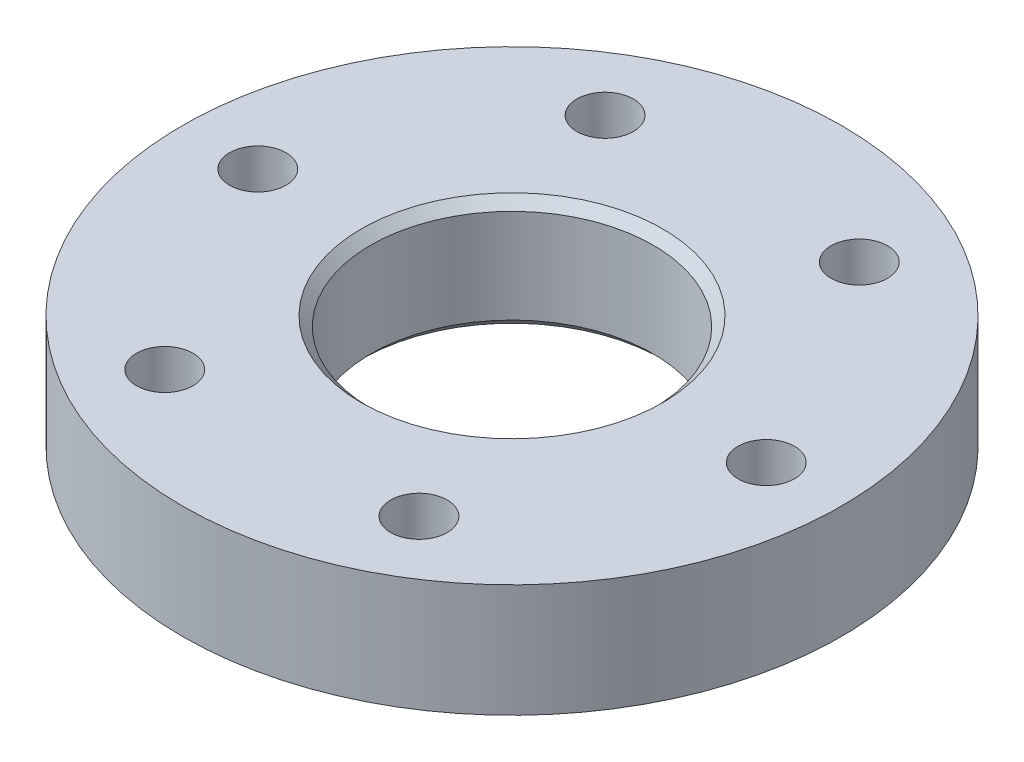
ISO-10303-21;
HEADER;
FILE_DESCRIPTION(('STEP AP214'),'2;1');
FILE_NAME('part.step','',(''),(''),'','','');
FILE_SCHEMA(('AUTOMOTIVE_DESIGN { 1 0 10303 214 1 1 1 1 }'));
ENDSEC;
DATA;
#1=APPLICATION_CONTEXT('core data for automotive mechanical design processes');
#2=APPLICATION_PROTOCOL_DEFINITION('international standard','automotive_design',2000,#1);
#3=PRODUCT_CONTEXT('',#1,'mechanical');
#4=PRODUCT('Part','Part','',(#3));
#5=PRODUCT_RELATED_PRODUCT_CATEGORY('part','',(#4));
#6=PRODUCT_DEFINITION_FORMATION('','',#4);
#7=PRODUCT_DEFINITION_CONTEXT('part definition',#1,'design');
#8=PRODUCT_DEFINITION('design','',#6,#7);
#9=PRODUCT_DEFINITION_SHAPE('','',#8);
#10=(LENGTH_UNIT() NAMED_UNIT(*) SI_UNIT(.MILLI.,.METRE.));
#11=(NAMED_UNIT(*) PLANE_ANGLE_UNIT() SI_UNIT($,.RADIAN.));
#12=(NAMED_UNIT(*) SI_UNIT($,.STERADIAN.) SOLID_ANGLE_UNIT());
#13=UNCERTAINTY_MEASURE_WITH_UNIT(LENGTH_MEASURE(1.E-05),#10,'distance_accuracy_value','');
#14=(GEOMETRIC_REPRESENTATION_CONTEXT(3) GLOBAL_UNCERTAINTY_ASSIGNED_CONTEXT((#13)) GLOBAL_UNIT_ASSIGNED_CONTEXT((#10,
#11,#12)) REPRESENTATION_CONTEXT('',''));
#15=CARTESIAN_POINT('',(0.,0.,0.));
#16=DIRECTION('',(0.,0.,1.));
#17=DIRECTION('',(1.,0.,0.));
#18=AXIS2_PLACEMENT_3D('',#15,#16,#17);
#19=CARTESIAN_POINT('',(13.5,3.,0.));
#20=DIRECTION('',(0.,-1.,0.));
#21=DIRECTION('',(0.,0.,-1.));
#22=AXIS2_PLACEMENT_3D('',#19,#20,#21);
#23=CYLINDRICAL_SURFACE('',#22,1.5);
#24=CARTESIAN_POINT('',(13.5,3.,0.));
#25=DIRECTION('',(0.,1.,0.));
#26=DIRECTION('',(0.,0.,1.));
#27=AXIS2_PLACEMENT_3D('',#24,#25,#26);
#28=CIRCLE('',#27,1.5);
#29=CARTESIAN_POINT('',(13.5,3.,1.5));
#30=VERTEX_POINT('',#29);
#31=EDGE_CURVE('E66',#30,#30,#28,.T.);
#32=ORIENTED_EDGE('',*,*,#31,.T.);
#33=EDGE_LOOP('',(#32));
#34=FACE_BOUND('',#33,.T.);
#35=CARTESIAN_POINT('',(13.5,-1.5,0.));
#36=DIRECTION('',(0.,-1.,0.));
#37=DIRECTION('',(0.,0.,-1.));
#38=AXIS2_PLACEMENT_3D('',#35,#36,#37);
#39=CIRCLE('',#38,1.5);
#40=CARTESIAN_POINT('',(13.5,-1.5,-1.5));
#41=VERTEX_POINT('',#40);
#42=EDGE_CURVE('E86',#41,#41,#39,.T.);
#43=ORIENTED_EDGE('',*,*,#42,.T.);
#44=EDGE_LOOP('',(#43));
#45=FACE_BOUND('',#44,.T.);
#46=ADVANCED_FACE('F38',(#34,#45),#23,.F.);
#47=CARTESIAN_POINT('',(6.74999999999997,3.,11.6913429510899));
#48=DIRECTION('',(0.,-1.,0.));
#49=DIRECTION('',(0.,0.,-1.));
#50=AXIS2_PLACEMENT_3D('',#47,#48,#49);
#51=CYLINDRICAL_SURFACE('',#50,1.5);
#52=CARTESIAN_POINT('',(6.74999999999997,3.,11.6913429510899));
#53=DIRECTION('',(0.,1.,0.));
#54=DIRECTION('',(0.,0.,1.));
#55=AXIS2_PLACEMENT_3D('',#52,#53,#54);
#56=CIRCLE('',#55,1.5);
#57=CARTESIAN_POINT('',(6.74999999999997,3.,13.1913429510899));
#58=VERTEX_POINT('',#57);
#59=EDGE_CURVE('E71',#58,#58,#56,.T.);
#60=ORIENTED_EDGE('',*,*,#59,.T.);
#61=EDGE_LOOP('',(#60));
#62=FACE_BOUND('',#61,.T.);
#63=CARTESIAN_POINT('',(6.74999999999997,-1.5,11.6913429510899));
#64=DIRECTION('',(0.,-1.,0.));
#65=DIRECTION('',(0.,0.,-1.));
#66=AXIS2_PLACEMENT_3D('',#63,#64,#65);
#67=CIRCLE('',#66,1.5);
#68=CARTESIAN_POINT('',(6.74999999999997,-1.5,10.1913429510899));
#69=VERTEX_POINT('',#68);
#70=EDGE_CURVE('E89',#69,#69,#67,.T.);
#71=ORIENTED_EDGE('',*,*,#70,.T.);
#72=EDGE_LOOP('',(#71));
#73=FACE_BOUND('',#72,.T.);
#74=ADVANCED_FACE('F120',(#62,#73),#51,.F.);
#75=CARTESIAN_POINT('',(-6.75000000000005,3.,11.6913429510899));
#76=DIRECTION('',(0.,-1.,0.));
#77=DIRECTION('',(0.,0.,-1.));
#78=AXIS2_PLACEMENT_3D('',#75,#76,#77);
#79=CYLINDRICAL_SURFACE('',#78,1.5);
#80=CARTESIAN_POINT('',(-6.75000000000005,3.,11.6913429510899));
#81=DIRECTION('',(0.,1.,0.));
#82=DIRECTION('',(0.,0.,1.));
#83=AXIS2_PLACEMENT_3D('',#80,#81,#82);
#84=CIRCLE('',#83,1.5);
#85=CARTESIAN_POINT('',(-6.75000000000005,3.,13.1913429510899));
#86=VERTEX_POINT('',#85);
#87=EDGE_CURVE('E74',#86,#86,#84,.T.);
#88=ORIENTED_EDGE('',*,*,#87,.T.);
#89=EDGE_LOOP('',(#88));
#90=FACE_BOUND('',#89,.T.);
#91=CARTESIAN_POINT('',(-6.75000000000005,-1.5,11.6913429510899));
#92=DIRECTION('',(0.,-1.,0.));
#93=DIRECTION('',(0.,0.,-1.));
#94=AXIS2_PLACEMENT_3D('',#91,#92,#93);
#95=CIRCLE('',#94,1.5);
#96=CARTESIAN_POINT('',(-6.75000000000005,-1.5,10.1913429510899));
#97=VERTEX_POINT('',#96);
#98=EDGE_CURVE('E92',#97,#97,#95,.T.);
#99=ORIENTED_EDGE('',*,*,#98,.T.);
#100=EDGE_LOOP('',(#99));
#101=FACE_BOUND('',#100,.T.);
#102=ADVANCED_FACE('F126',(#90,#101),#79,.F.);
#103=CARTESIAN_POINT('',(-13.5,3.,0.));
#104=DIRECTION('',(0.,-1.,0.));
#105=DIRECTION('',(0.,0.,-1.));
#106=AXIS2_PLACEMENT_3D('',#103,#104,#105);
#107=CYLINDRICAL_SURFACE('',#106,1.5);
#108=CARTESIAN_POINT('',(-13.5,3.,0.));
#109=DIRECTION('',(0.,1.,0.));
#110=DIRECTION('',(0.,0.,1.));
#111=AXIS2_PLACEMENT_3D('',#108,#109,#110);
#112=CIRCLE('',#111,1.5);
#113=CARTESIAN_POINT('',(-13.5,3.,1.4999999999999));
#114=VERTEX_POINT('',#113);
#115=EDGE_CURVE('E77',#114,#114,#112,.T.);
#116=ORIENTED_EDGE('',*,*,#115,.T.);
#117=EDGE_LOOP('',(#116));
#118=FACE_BOUND('',#117,.T.);
#119=CARTESIAN_POINT('',(-13.5,-1.5,0.));
#120=DIRECTION('',(0.,-1.,0.));
#121=DIRECTION('',(0.,0.,-1.));
#122=AXIS2_PLACEMENT_3D('',#119,#120,#121);
#123=CIRCLE('',#122,1.5);
#124=CARTESIAN_POINT('',(-13.5,-1.5,-1.50000000000009));
#125=VERTEX_POINT('',#124);
#126=EDGE_CURVE('E95',#125,#125,#123,.T.);
#127=ORIENTED_EDGE('',*,*,#126,.T.);
#128=EDGE_LOOP('',(#127));
#129=FACE_BOUND('',#128,.T.);
#130=ADVANCED_FACE('F177',(#118,#129),#107,.F.);
#131=CARTESIAN_POINT('',(-6.74999999999989,3.,-11.69134295109));
#132=DIRECTION('',(0.,-1.,0.));
#133=DIRECTION('',(0.,0.,-1.));
#134=AXIS2_PLACEMENT_3D('',#131,#132,#133);
#135=CYLINDRICAL_SURFACE('',#134,1.5);
#136=CARTESIAN_POINT('',(-6.74999999999989,3.,-11.69134295109));
#137=DIRECTION('',(0.,1.,0.));
#138=DIRECTION('',(0.,0.,1.));
#139=AXIS2_PLACEMENT_3D('',#136,#137,#138);
#140=CIRCLE('',#139,1.5);
#141=CARTESIAN_POINT('',(-6.74999999999989,3.,-10.19134295109));
#142=VERTEX_POINT('',#141);
#143=EDGE_CURVE('E80',#142,#142,#140,.T.);
#144=ORIENTED_EDGE('',*,*,#143,.T.);
#145=EDGE_LOOP('',(#144));
#146=FACE_BOUND('',#145,.T.);
#147=CARTESIAN_POINT('',(-6.74999999999989,-1.5,-11.69134295109));
#148=DIRECTION('',(0.,-1.,0.));
#149=DIRECTION('',(0.,0.,-1.));
#150=AXIS2_PLACEMENT_3D('',#147,#148,#149);
#151=CIRCLE('',#150,1.5);
#152=CARTESIAN_POINT('',(-6.74999999999989,-1.5,-13.19134295109));
#153=VERTEX_POINT('',#152);
#154=EDGE_CURVE('E98',#153,#153,#151,.T.);
#155=ORIENTED_EDGE('',*,*,#154,.T.);
#156=EDGE_LOOP('',(#155));
#157=FACE_BOUND('',#156,.T.);
#158=ADVANCED_FACE('F102',(#146,#157),#135,.F.);
#159=CARTESIAN_POINT('',(6.75000000000014,3.,-11.6913429510898));
#160=DIRECTION('',(0.,-1.,0.));
#161=DIRECTION('',(0.,0.,-1.));
#162=AXIS2_PLACEMENT_3D('',#159,#160,#161);
#163=CYLINDRICAL_SURFACE('',#162,1.5);
#164=CARTESIAN_POINT('',(6.75000000000014,3.,-11.6913429510898));
#165=DIRECTION('',(0.,1.,0.));
#166=DIRECTION('',(0.,0.,1.));
#167=AXIS2_PLACEMENT_3D('',#164,#165,#166);
#168=CIRCLE('',#167,1.5);
#169=CARTESIAN_POINT('',(6.75000000000014,3.,-10.1913429510898));
#170=VERTEX_POINT('',#169);
#171=EDGE_CURVE('E83',#170,#170,#168,.T.);
#172=ORIENTED_EDGE('',*,*,#171,.T.);
#173=EDGE_LOOP('',(#172));
#174=FACE_BOUND('',#173,.T.);
#175=CARTESIAN_POINT('',(6.75000000000014,-1.5,-11.6913429510898));
#176=DIRECTION('',(0.,-1.,0.));
#177=DIRECTION('',(0.,0.,-1.));
#178=AXIS2_PLACEMENT_3D('',#175,#176,#177);
#179=CIRCLE('',#178,1.5);
#180=CARTESIAN_POINT('',(6.75000000000014,-1.5,-13.1913429510898));
#181=VERTEX_POINT('',#180);
#182=EDGE_CURVE('E59',#181,#181,#179,.T.);
#183=ORIENTED_EDGE('',*,*,#182,.T.);
#184=EDGE_LOOP('',(#183));
#185=FACE_BOUND('',#184,.T.);
#186=ADVANCED_FACE('F136',(#174,#185),#163,.F.);
#187=CARTESIAN_POINT('',(0.,3.,0.));
#188=DIRECTION('',(0.,1.,0.));
#189=DIRECTION('',(0.,0.,1.));
#190=AXIS2_PLACEMENT_3D('',#187,#188,#189);
#191=PLANE('',#190);
#192=CARTESIAN_POINT('',(0.,3.,0.));
#193=DIRECTION('',(0.,1.,0.));
#194=DIRECTION('',(0.,0.,1.));
#195=AXIS2_PLACEMENT_3D('',#192,#193,#194);
#196=CIRCLE('',#195,8.00000000000001);
#197=CARTESIAN_POINT('',(0.,3.,8.00000000000001));
#198=VERTEX_POINT('',#197);
#199=EDGE_CURVE('E10',#198,#198,#196,.F.);
#200=ORIENTED_EDGE('',*,*,#199,.T.);
#201=EDGE_LOOP('',(#200));
#202=FACE_BOUND('',#201,.T.);
#203=ORIENTED_EDGE('',*,*,#143,.F.);
#204=EDGE_LOOP('',(#203));
#205=FACE_BOUND('',#204,.T.);
#206=ORIENTED_EDGE('',*,*,#87,.F.);
#207=EDGE_LOOP('',(#206));
#208=FACE_BOUND('',#207,.T.);
#209=CARTESIAN_POINT('',(0.,3.,0.));
#210=DIRECTION('',(0.,1.,0.));
#211=DIRECTION('',(0.,0.,1.));
#212=AXIS2_PLACEMENT_3D('',#209,#210,#211);
#213=CIRCLE('',#212,17.5);
#214=CARTESIAN_POINT('',(0.,3.,17.5));
#215=VERTEX_POINT('',#214);
#216=EDGE_CURVE('E62',#215,#215,#213,.T.);
#217=ORIENTED_EDGE('',*,*,#216,.T.);
#218=EDGE_LOOP('',(#217));
#219=FACE_BOUND('',#218,.T.);
#220=ORIENTED_EDGE('',*,*,#31,.F.);
#221=EDGE_LOOP('',(#220));
#222=FACE_BOUND('',#221,.T.);
#223=ORIENTED_EDGE('',*,*,#59,.F.);
#224=EDGE_LOOP('',(#223));
#225=FACE_BOUND('',#224,.T.);
#226=ORIENTED_EDGE('',*,*,#115,.F.);
#227=EDGE_LOOP('',(#226));
#228=FACE_BOUND('',#227,.T.);
#229=ORIENTED_EDGE('',*,*,#171,.F.);
#230=EDGE_LOOP('',(#229));
#231=FACE_BOUND('',#230,.T.);
#232=ADVANCED_FACE('F132',(#202,#205,#208,#219,#222,#225,#228,#231),#191,.T.);
#233=CARTESIAN_POINT('',(0.,-3.,0.));
#234=DIRECTION('',(0.,1.,0.));
#235=DIRECTION('',(0.,0.,1.));
#236=AXIS2_PLACEMENT_3D('',#233,#234,#235);
#237=PLANE('',#236);
#238=CARTESIAN_POINT('',(0.,-3.,0.));
#239=DIRECTION('',(0.,1.,0.));
#240=DIRECTION('',(0.,0.,1.));
#241=AXIS2_PLACEMENT_3D('',#238,#239,#240);
#242=CIRCLE('',#241,7.99999999999999);
#243=CARTESIAN_POINT('',(0.,-3.,7.99999999999999));
#244=VERTEX_POINT('',#243);
#245=EDGE_CURVE('E54',#244,#244,#242,.T.);
#246=ORIENTED_EDGE('',*,*,#245,.T.);
#247=EDGE_LOOP('',(#246));
#248=FACE_BOUND('',#247,.T.);
#249=CARTESIAN_POINT('',(0.,-3.,0.));
#250=DIRECTION('',(0.,1.,0.));
#251=DIRECTION('',(0.,0.,1.));
#252=AXIS2_PLACEMENT_3D('',#249,#250,#251);
#253=CIRCLE('',#252,17.5);
#254=CARTESIAN_POINT('',(0.,-3.,17.5));
#255=VERTEX_POINT('',#254);
#256=EDGE_CURVE('E63',#255,#255,#253,.T.);
#257=ORIENTED_EDGE('',*,*,#256,.F.);
#258=EDGE_LOOP('',(#257));
#259=FACE_BOUND('',#258,.T.);
#260=ADVANCED_FACE('F135',(#248,#259),#237,.F.);
#261=CARTESIAN_POINT('',(0.,3.,0.));
#262=DIRECTION('',(0.,-1.,0.));
#263=DIRECTION('',(0.,0.,-1.));
#264=AXIS2_PLACEMENT_3D('',#261,#262,#263);
#265=CYLINDRICAL_SURFACE('',#264,17.5);
#266=ORIENTED_EDGE('',*,*,#216,.F.);
#267=EDGE_LOOP('',(#266));
#268=FACE_BOUND('',#267,.T.);
#269=ORIENTED_EDGE('',*,*,#256,.T.);
#270=EDGE_LOOP('',(#269));
#271=FACE_BOUND('',#270,.T.);
#272=ADVANCED_FACE('F139',(#268,#271),#265,.T.);
#273=CARTESIAN_POINT('',(0.,3.,0.));
#274=DIRECTION('',(0.,-1.,0.));
#275=DIRECTION('',(0.,0.,-1.));
#276=AXIS2_PLACEMENT_3D('',#273,#274,#275);
#277=CYLINDRICAL_SURFACE('',#276,7.5);
#278=CARTESIAN_POINT('',(0.,-2.50000000000001,0.));
#279=DIRECTION('',(0.,1.,0.));
#280=DIRECTION('',(0.,0.,1.));
#281=AXIS2_PLACEMENT_3D('',#278,#279,#280);
#282=CIRCLE('',#281,7.5);
#283=CARTESIAN_POINT('',(0.,-2.50000000000001,7.5));
#284=VERTEX_POINT('',#283);
#285=EDGE_CURVE('E46',#284,#284,#282,.F.);
#286=ORIENTED_EDGE('',*,*,#285,.T.);
#287=EDGE_LOOP('',(#286));
#288=FACE_BOUND('',#287,.T.);
#289=CARTESIAN_POINT('',(0.,2.49999999999999,0.));
#290=DIRECTION('',(0.,1.,0.));
#291=DIRECTION('',(0.,0.,1.));
#292=AXIS2_PLACEMENT_3D('',#289,#290,#291);
#293=CIRCLE('',#292,7.5);
#294=CARTESIAN_POINT('',(0.,2.49999999999999,7.5));
#295=VERTEX_POINT('',#294);
#296=EDGE_CURVE('E50',#295,#295,#293,.T.);
#297=ORIENTED_EDGE('',*,*,#296,.T.);
#298=EDGE_LOOP('',(#297));
#299=FACE_BOUND('',#298,.T.);
#300=ADVANCED_FACE('F115',(#288,#299),#277,.F.);
#301=CARTESIAN_POINT('',(0.,-1.5,0.));
#302=DIRECTION('',(0.,-1.,0.));
#303=DIRECTION('',(0.,0.,-1.));
#304=AXIS2_PLACEMENT_3D('',#301,#302,#303);
#305=PLANE('',#304);
#306=ORIENTED_EDGE('',*,*,#182,.F.);
#307=EDGE_LOOP('',(#306));
#308=FACE_BOUND('',#307,.T.);
#309=ADVANCED_FACE('F107',(#308),#305,.F.);
#310=ORIENTED_EDGE('',*,*,#154,.F.);
#311=EDGE_LOOP('',(#310));
#312=FACE_BOUND('',#311,.T.);
#313=ADVANCED_FACE('F104',(#312),#305,.F.);
#314=ORIENTED_EDGE('',*,*,#126,.F.);
#315=EDGE_LOOP('',(#314));
#316=FACE_BOUND('',#315,.T.);
#317=ADVANCED_FACE('F106',(#316),#305,.F.);
#318=ORIENTED_EDGE('',*,*,#98,.F.);
#319=EDGE_LOOP('',(#318));
#320=FACE_BOUND('',#319,.T.);
#321=ADVANCED_FACE('F113',(#320),#305,.F.);
#322=ORIENTED_EDGE('',*,*,#70,.F.);
#323=EDGE_LOOP('',(#322));
#324=FACE_BOUND('',#323,.T.);
#325=ADVANCED_FACE('F154',(#324),#305,.F.);
#326=ORIENTED_EDGE('',*,*,#42,.F.);
#327=EDGE_LOOP('',(#326));
#328=FACE_BOUND('',#327,.T.);
#329=ADVANCED_FACE('F117',(#328),#305,.F.);
#330=CARTESIAN_POINT('',(0.,-3.,0.));
#331=DIRECTION('',(0.,-1.,0.));
#332=DIRECTION('',(0.,0.,-1.));
#333=AXIS2_PLACEMENT_3D('',#330,#331,#332);
#334=CONICAL_SURFACE('',#333,7.99999999999999,0.785398163397447);
#335=ORIENTED_EDGE('',*,*,#285,.F.);
#336=EDGE_LOOP('',(#335));
#337=FACE_BOUND('',#336,.T.);
#338=ORIENTED_EDGE('',*,*,#245,.F.);
#339=EDGE_LOOP('',(#338));
#340=FACE_BOUND('',#339,.T.);
#341=ADVANCED_FACE('F144',(#337,#340),#334,.F.);
#342=CARTESIAN_POINT('',(0.,2.49999999999999,0.));
#343=DIRECTION('',(0.,1.,0.));
#344=DIRECTION('',(0.,0.,1.));
#345=AXIS2_PLACEMENT_3D('',#342,#343,#344);
#346=CONICAL_SURFACE('',#345,7.5,0.785398163397456);
#347=ORIENTED_EDGE('',*,*,#199,.F.);
#348=EDGE_LOOP('',(#347));
#349=FACE_BOUND('',#348,.T.);
#350=ORIENTED_EDGE('',*,*,#296,.F.);
#351=EDGE_LOOP('',(#350));
#352=FACE_BOUND('',#351,.T.);
#353=ADVANCED_FACE('F41',(#349,#352),#346,.F.);
#354=CLOSED_SHELL('',(#46,#74,#102,#130,#158,#186,#232,#260,#272,#300,#309,#313,#317,#321,#325,
#329,#341,#353));
#355=MANIFOLD_SOLID_BREP('B2',#354);
#356=ADVANCED_BREP_SHAPE_REPRESENTATION('',(#18,#355),#14);
#357=SHAPE_DEFINITION_REPRESENTATION(#9,#356);
ENDSEC;
END-ISO-10303-21;
